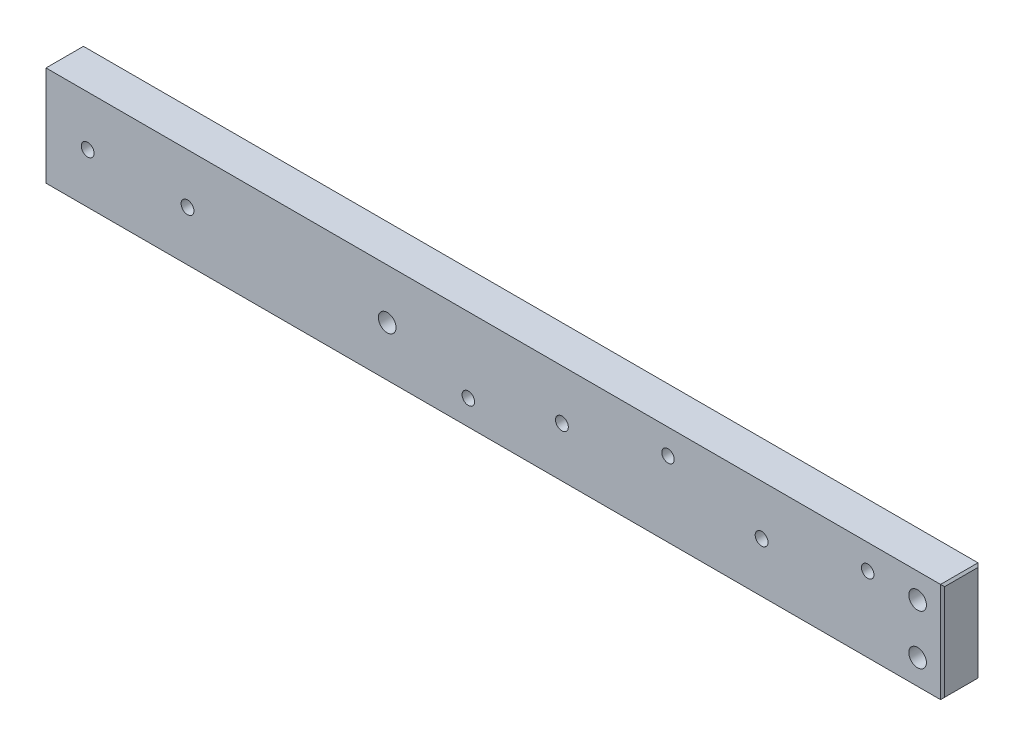
ISO-10303-21;
HEADER;
FILE_DESCRIPTION(('STEP AP214'),'2;1');
FILE_NAME('part.step','',(''),(''),'','','');
FILE_SCHEMA(('AUTOMOTIVE_DESIGN { 1 0 10303 214 1 1 1 1 }'));
ENDSEC;
DATA;
#1=APPLICATION_CONTEXT('core data for automotive mechanical design processes');
#2=APPLICATION_PROTOCOL_DEFINITION('international standard','automotive_design',2000,#1);
#3=PRODUCT_CONTEXT('',#1,'mechanical');
#4=PRODUCT('Part','Part','',(#3));
#5=PRODUCT_RELATED_PRODUCT_CATEGORY('part','',(#4));
#6=PRODUCT_DEFINITION_FORMATION('','',#4);
#7=PRODUCT_DEFINITION_CONTEXT('part definition',#1,'design');
#8=PRODUCT_DEFINITION('design','',#6,#7);
#9=PRODUCT_DEFINITION_SHAPE('','',#8);
#10=(LENGTH_UNIT() NAMED_UNIT(*) SI_UNIT(.MILLI.,.METRE.));
#11=(NAMED_UNIT(*) PLANE_ANGLE_UNIT() SI_UNIT($,.RADIAN.));
#12=(NAMED_UNIT(*) SI_UNIT($,.STERADIAN.) SOLID_ANGLE_UNIT());
#13=UNCERTAINTY_MEASURE_WITH_UNIT(LENGTH_MEASURE(1.E-05),#10,'distance_accuracy_value','');
#14=(GEOMETRIC_REPRESENTATION_CONTEXT(3) GLOBAL_UNCERTAINTY_ASSIGNED_CONTEXT((#13)) GLOBAL_UNIT_ASSIGNED_CONTEXT((#10,
#11,#12)) REPRESENTATION_CONTEXT('',''));
#15=CARTESIAN_POINT('',(0.,0.,0.));
#16=DIRECTION('',(0.,0.,1.));
#17=DIRECTION('',(1.,0.,0.));
#18=AXIS2_PLACEMENT_3D('',#15,#16,#17);
#19=CARTESIAN_POINT('',(0.,0.,9.525));
#20=DIRECTION('',(-1.,0.,0.));
#21=DIRECTION('',(0.,0.,1.));
#22=AXIS2_PLACEMENT_3D('',#19,#20,#21);
#23=PLANE('',#22);
#24=DIRECTION('',(0.,-1.,0.));
#25=VECTOR('',#24,1.);
#26=CARTESIAN_POINT('',(0.,0.,9.01699999999999));
#27=LINE('',#26,#25);
#28=CARTESIAN_POINT('',(0.,24.892,9.01699999999999));
#29=VERTEX_POINT('',#28);
#30=CARTESIAN_POINT('',(0.,0.508000000000008,9.01699999999999));
#31=VERTEX_POINT('',#30);
#32=EDGE_CURVE('E123',#29,#31,#27,.T.);
#33=ORIENTED_EDGE('',*,*,#32,.T.);
#34=DIRECTION('',(0.,0.,-1.));
#35=VECTOR('',#34,1.);
#36=CARTESIAN_POINT('',(0.,0.508000000000008,9.525));
#37=LINE('',#36,#35);
#38=CARTESIAN_POINT('',(0.,0.508000000000008,0.508000000000008));
#39=VERTEX_POINT('',#38);
#40=EDGE_CURVE('E105',#31,#39,#37,.T.);
#41=ORIENTED_EDGE('',*,*,#40,.T.);
#42=DIRECTION('',(0.,1.,0.));
#43=VECTOR('',#42,1.);
#44=CARTESIAN_POINT('',(0.,0.,0.508000000000008));
#45=LINE('',#44,#43);
#46=CARTESIAN_POINT('',(0.,24.892,0.508000000000008));
#47=VERTEX_POINT('',#46);
#48=EDGE_CURVE('E113',#39,#47,#45,.T.);
#49=ORIENTED_EDGE('',*,*,#48,.T.);
#50=DIRECTION('',(0.,0.,1.));
#51=VECTOR('',#50,1.);
#52=CARTESIAN_POINT('',(0.,24.892,9.525));
#53=LINE('',#52,#51);
#54=EDGE_CURVE('E119',#47,#29,#53,.T.);
#55=ORIENTED_EDGE('',*,*,#54,.T.);
#56=EDGE_LOOP('',(#33,#41,#49,#55));
#57=FACE_BOUND('',#56,.T.);
#58=ADVANCED_FACE('F35',(#57),#23,.F.);
#59=CARTESIAN_POINT('',(0.,25.4,9.525));
#60=DIRECTION('',(0.,-1.,0.));
#61=DIRECTION('',(1.,0.,0.));
#62=AXIS2_PLACEMENT_3D('',#59,#60,#61);
#63=PLANE('',#62);
#64=DIRECTION('',(-1.,0.,0.));
#65=VECTOR('',#64,1.);
#66=CARTESIAN_POINT('',(0.,25.4,9.525));
#67=LINE('',#66,#65);
#68=CARTESIAN_POINT('',(-0.508000000000008,25.4,9.525));
#69=VERTEX_POINT('',#68);
#70=CARTESIAN_POINT('',(-228.092,25.4,9.525));
#71=VERTEX_POINT('',#70);
#72=EDGE_CURVE('E182',#69,#71,#67,.T.);
#73=ORIENTED_EDGE('',*,*,#72,.F.);
#74=DIRECTION('',(0.,0.,-1.));
#75=VECTOR('',#74,1.);
#76=CARTESIAN_POINT('',(-0.508000000000008,25.4,9.525));
#77=LINE('',#76,#75);
#78=CARTESIAN_POINT('',(-0.508000000000008,25.4,0.));
#79=VERTEX_POINT('',#78);
#80=EDGE_CURVE('E139',#69,#79,#77,.T.);
#81=ORIENTED_EDGE('',*,*,#80,.T.);
#82=DIRECTION('',(-1.,0.,0.));
#83=VECTOR('',#82,1.);
#84=CARTESIAN_POINT('',(0.,25.4,0.));
#85=LINE('',#84,#83);
#86=CARTESIAN_POINT('',(-228.092,25.4,0.));
#87=VERTEX_POINT('',#86);
#88=EDGE_CURVE('E183',#79,#87,#85,.T.);
#89=ORIENTED_EDGE('',*,*,#88,.T.);
#90=DIRECTION('',(0.,0.,1.));
#91=VECTOR('',#90,1.);
#92=CARTESIAN_POINT('',(-228.092,25.4,9.525));
#93=LINE('',#92,#91);
#94=EDGE_CURVE('E136',#87,#71,#93,.T.);
#95=ORIENTED_EDGE('',*,*,#94,.T.);
#96=EDGE_LOOP('',(#73,#81,#89,#95));
#97=FACE_BOUND('',#96,.T.);
#98=ADVANCED_FACE('F297',(#97),#63,.F.);
#99=CARTESIAN_POINT('',(-228.6,0.,9.525));
#100=DIRECTION('',(1.,0.,0.));
#101=DIRECTION('',(0.,0.,-1.));
#102=AXIS2_PLACEMENT_3D('',#99,#100,#101);
#103=PLANE('',#102);
#104=DIRECTION('',(0.,1.,0.));
#105=VECTOR('',#104,1.);
#106=CARTESIAN_POINT('',(-228.6,25.4,9.01699999999999));
#107=LINE('',#106,#105);
#108=CARTESIAN_POINT('',(-228.6,0.50799999999998,9.01699999999999));
#109=VERTEX_POINT('',#108);
#110=CARTESIAN_POINT('',(-228.6,24.892,9.01699999999999));
#111=VERTEX_POINT('',#110);
#112=EDGE_CURVE('E44',#109,#111,#107,.T.);
#113=ORIENTED_EDGE('',*,*,#112,.T.);
#114=DIRECTION('',(0.,0.,-1.));
#115=VECTOR('',#114,1.);
#116=CARTESIAN_POINT('',(-228.6,24.892,9.525));
#117=LINE('',#116,#115);
#118=CARTESIAN_POINT('',(-228.6,24.892,0.508000000000008));
#119=VERTEX_POINT('',#118);
#120=EDGE_CURVE('E11',#111,#119,#117,.T.);
#121=ORIENTED_EDGE('',*,*,#120,.T.);
#122=DIRECTION('',(0.,-1.,0.));
#123=VECTOR('',#122,1.);
#124=CARTESIAN_POINT('',(-228.6,0.,0.508000000000008));
#125=LINE('',#124,#123);
#126=CARTESIAN_POINT('',(-228.6,0.50799999999998,0.508000000000008));
#127=VERTEX_POINT('',#126);
#128=EDGE_CURVE('E145',#119,#127,#125,.T.);
#129=ORIENTED_EDGE('',*,*,#128,.T.);
#130=DIRECTION('',(0.,0.,1.));
#131=VECTOR('',#130,1.);
#132=CARTESIAN_POINT('',(-228.6,0.50799999999998,9.525));
#133=LINE('',#132,#131);
#134=EDGE_CURVE('E55',#127,#109,#133,.T.);
#135=ORIENTED_EDGE('',*,*,#134,.T.);
#136=EDGE_LOOP('',(#113,#121,#129,#135));
#137=FACE_BOUND('',#136,.T.);
#138=ADVANCED_FACE('F302',(#137),#103,.F.);
#139=CARTESIAN_POINT('',(0.,0.,9.525));
#140=DIRECTION('',(0.,1.,0.));
#141=DIRECTION('',(-1.,0.,0.));
#142=AXIS2_PLACEMENT_3D('',#139,#140,#141);
#143=PLANE('',#142);
#144=DIRECTION('',(1.,0.,0.));
#145=VECTOR('',#144,1.);
#146=CARTESIAN_POINT('',(0.,0.,0.));
#147=LINE('',#146,#145);
#148=CARTESIAN_POINT('',(-228.092,0.,0.));
#149=VERTEX_POINT('',#148);
#150=CARTESIAN_POINT('',(-0.508000000000008,0.,0.));
#151=VERTEX_POINT('',#150);
#152=EDGE_CURVE('E176',#149,#151,#147,.T.);
#153=ORIENTED_EDGE('',*,*,#152,.T.);
#154=DIRECTION('',(0.,0.,1.));
#155=VECTOR('',#154,1.);
#156=CARTESIAN_POINT('',(-0.508000000000008,0.,9.525));
#157=LINE('',#156,#155);
#158=CARTESIAN_POINT('',(-0.508000000000008,0.,9.525));
#159=VERTEX_POINT('',#158);
#160=EDGE_CURVE('E107',#151,#159,#157,.T.);
#161=ORIENTED_EDGE('',*,*,#160,.T.);
#162=DIRECTION('',(1.,0.,0.));
#163=VECTOR('',#162,1.);
#164=CARTESIAN_POINT('',(0.,0.,9.525));
#165=LINE('',#164,#163);
#166=CARTESIAN_POINT('',(-228.092,0.,9.525));
#167=VERTEX_POINT('',#166);
#168=EDGE_CURVE('E120',#167,#159,#165,.T.);
#169=ORIENTED_EDGE('',*,*,#168,.F.);
#170=DIRECTION('',(0.,0.,-1.));
#171=VECTOR('',#170,1.);
#172=CARTESIAN_POINT('',(-228.092,0.,9.525));
#173=LINE('',#172,#171);
#174=EDGE_CURVE('E125',#167,#149,#173,.T.);
#175=ORIENTED_EDGE('',*,*,#174,.T.);
#176=EDGE_LOOP('',(#153,#161,#169,#175));
#177=FACE_BOUND('',#176,.T.);
#178=ADVANCED_FACE('F175',(#177),#143,.F.);
#179=CARTESIAN_POINT('',(0.,0.,9.525));
#180=DIRECTION('',(0.,0.,1.));
#181=DIRECTION('',(1.,0.,0.));
#182=AXIS2_PLACEMENT_3D('',#179,#180,#181);
#183=PLANE('',#182);
#184=CARTESIAN_POINT('',(-19.05,19.05,9.525));
#185=DIRECTION('',(0.,0.,1.));
#186=DIRECTION('',(1.,0.,0.));
#187=AXIS2_PLACEMENT_3D('',#184,#185,#186);
#188=CIRCLE('',#187,1.5875);
#189=CARTESIAN_POINT('',(-17.4625,19.05,9.525));
#190=VERTEX_POINT('',#189);
#191=EDGE_CURVE('E255',#190,#190,#188,.T.);
#192=ORIENTED_EDGE('',*,*,#191,.F.);
#193=EDGE_LOOP('',(#192));
#194=FACE_BOUND('',#193,.T.);
#195=CARTESIAN_POINT('',(-69.85,19.05,9.525));
#196=DIRECTION('',(0.,0.,1.));
#197=DIRECTION('',(1.,0.,0.));
#198=AXIS2_PLACEMENT_3D('',#195,#196,#197);
#199=CIRCLE('',#198,1.58750000000001);
#200=CARTESIAN_POINT('',(-68.2625,19.05,9.525));
#201=VERTEX_POINT('',#200);
#202=EDGE_CURVE('E249',#201,#201,#199,.T.);
#203=ORIENTED_EDGE('',*,*,#202,.F.);
#204=EDGE_LOOP('',(#203));
#205=FACE_BOUND('',#204,.T.);
#206=CARTESIAN_POINT('',(-120.65,6.34999999999997,9.525));
#207=DIRECTION('',(0.,0.,1.));
#208=DIRECTION('',(1.,0.,0.));
#209=AXIS2_PLACEMENT_3D('',#206,#207,#208);
#210=CIRCLE('',#209,1.58750000000001);
#211=CARTESIAN_POINT('',(-119.0625,6.34999999999997,9.525));
#212=VERTEX_POINT('',#211);
#213=EDGE_CURVE('E243',#212,#212,#210,.T.);
#214=ORIENTED_EDGE('',*,*,#213,.F.);
#215=EDGE_LOOP('',(#214));
#216=FACE_BOUND('',#215,.T.);
#217=CARTESIAN_POINT('',(-217.4875,12.7,9.525));
#218=DIRECTION('',(0.,0.,1.));
#219=DIRECTION('',(1.,0.,0.));
#220=AXIS2_PLACEMENT_3D('',#217,#218,#219);
#221=CIRCLE('',#220,1.63194999999999);
#222=CARTESIAN_POINT('',(-215.85555,12.7,9.525));
#223=VERTEX_POINT('',#222);
#224=EDGE_CURVE('E237',#223,#223,#221,.T.);
#225=ORIENTED_EDGE('',*,*,#224,.F.);
#226=EDGE_LOOP('',(#225));
#227=FACE_BOUND('',#226,.T.);
#228=CARTESIAN_POINT('',(-192.0875,12.7,9.525));
#229=DIRECTION('',(0.,0.,1.));
#230=DIRECTION('',(1.,0.,0.));
#231=AXIS2_PLACEMENT_3D('',#228,#229,#230);
#232=CIRCLE('',#231,1.63194999999999);
#233=CARTESIAN_POINT('',(-190.45555,12.7,9.525));
#234=VERTEX_POINT('',#233);
#235=EDGE_CURVE('E231',#234,#234,#232,.T.);
#236=ORIENTED_EDGE('',*,*,#235,.F.);
#237=EDGE_LOOP('',(#236));
#238=FACE_BOUND('',#237,.T.);
#239=CARTESIAN_POINT('',(-96.8375,12.7,9.525));
#240=DIRECTION('',(0.,0.,-1.));
#241=DIRECTION('',(-1.,0.,0.));
#242=AXIS2_PLACEMENT_3D('',#239,#240,#241);
#243=CIRCLE('',#242,1.63194999999999);
#244=CARTESIAN_POINT('',(-98.46945,12.7,9.525));
#245=VERTEX_POINT('',#244);
#246=EDGE_CURVE('E222',#245,#245,#243,.T.);
#247=ORIENTED_EDGE('',*,*,#246,.T.);
#248=EDGE_LOOP('',(#247));
#249=FACE_BOUND('',#248,.T.);
#250=CARTESIAN_POINT('',(-46.0375000000001,12.7,9.525));
#251=DIRECTION('',(0.,0.,-1.));
#252=DIRECTION('',(-1.,0.,0.));
#253=AXIS2_PLACEMENT_3D('',#250,#251,#252);
#254=CIRCLE('',#253,1.63194999999999);
#255=CARTESIAN_POINT('',(-47.66945,12.7,9.525));
#256=VERTEX_POINT('',#255);
#257=EDGE_CURVE('E158',#256,#256,#254,.T.);
#258=ORIENTED_EDGE('',*,*,#257,.T.);
#259=EDGE_LOOP('',(#258));
#260=FACE_BOUND('',#259,.T.);
#261=CARTESIAN_POINT('',(-141.2875,12.7,9.525));
#262=DIRECTION('',(0.,0.,1.));
#263=DIRECTION('',(1.,0.,0.));
#264=AXIS2_PLACEMENT_3D('',#261,#262,#263);
#265=CIRCLE('',#264,2.2479);
#266=CARTESIAN_POINT('',(-139.0396,12.7,9.525));
#267=VERTEX_POINT('',#266);
#268=EDGE_CURVE('E154',#267,#267,#265,.T.);
#269=ORIENTED_EDGE('',*,*,#268,.F.);
#270=EDGE_LOOP('',(#269));
#271=FACE_BOUND('',#270,.T.);
#272=CARTESIAN_POINT('',(-6.35,6.34999999999999,9.525));
#273=DIRECTION('',(0.,0.,1.));
#274=DIRECTION('',(1.,0.,0.));
#275=AXIS2_PLACEMENT_3D('',#272,#273,#274);
#276=CIRCLE('',#275,2.24789999999999);
#277=CARTESIAN_POINT('',(-4.10210000000001,6.34999999999999,9.525));
#278=VERTEX_POINT('',#277);
#279=EDGE_CURVE('E195',#278,#278,#276,.T.);
#280=ORIENTED_EDGE('',*,*,#279,.F.);
#281=EDGE_LOOP('',(#280));
#282=FACE_BOUND('',#281,.T.);
#283=CARTESIAN_POINT('',(-6.35,19.05,9.525));
#284=DIRECTION('',(0.,0.,1.));
#285=DIRECTION('',(1.,0.,0.));
#286=AXIS2_PLACEMENT_3D('',#283,#284,#285);
#287=CIRCLE('',#286,2.24789999999999);
#288=CARTESIAN_POINT('',(-4.10210000000001,19.05,9.525));
#289=VERTEX_POINT('',#288);
#290=EDGE_CURVE('E194',#289,#289,#287,.T.);
#291=ORIENTED_EDGE('',*,*,#290,.F.);
#292=EDGE_LOOP('',(#291));
#293=FACE_BOUND('',#292,.T.);
#294=ORIENTED_EDGE('',*,*,#168,.T.);
#295=DIRECTION('',(0.,1.,0.));
#296=VECTOR('',#295,1.);
#297=CARTESIAN_POINT('',(-0.508000000000008,25.4,9.525));
#298=LINE('',#297,#296);
#299=EDGE_CURVE('E134',#159,#69,#298,.T.);
#300=ORIENTED_EDGE('',*,*,#299,.T.);
#301=ORIENTED_EDGE('',*,*,#72,.T.);
#302=DIRECTION('',(0.,-1.,0.));
#303=VECTOR('',#302,1.);
#304=CARTESIAN_POINT('',(-228.092,0.,9.525));
#305=LINE('',#304,#303);
#306=EDGE_CURVE('E132',#71,#167,#305,.T.);
#307=ORIENTED_EDGE('',*,*,#306,.T.);
#308=EDGE_LOOP('',(#294,#300,#301,#307));
#309=FACE_BOUND('',#308,.T.);
#310=ADVANCED_FACE('F207',(#194,#205,#216,#227,#238,#249,#260,#271,#282,#293,#309),#183,.T.);
#311=CARTESIAN_POINT('',(0.,0.,0.));
#312=DIRECTION('',(0.,0.,1.));
#313=DIRECTION('',(1.,0.,0.));
#314=AXIS2_PLACEMENT_3D('',#311,#312,#313);
#315=PLANE('',#314);
#316=CARTESIAN_POINT('',(-19.05,19.05,0.));
#317=DIRECTION('',(0.,0.,1.));
#318=DIRECTION('',(1.,0.,0.));
#319=AXIS2_PLACEMENT_3D('',#316,#317,#318);
#320=CIRCLE('',#319,1.5875);
#321=CARTESIAN_POINT('',(-17.4625,19.05,0.));
#322=VERTEX_POINT('',#321);
#323=EDGE_CURVE('E252',#322,#322,#320,.T.);
#324=ORIENTED_EDGE('',*,*,#323,.T.);
#325=EDGE_LOOP('',(#324));
#326=FACE_BOUND('',#325,.T.);
#327=CARTESIAN_POINT('',(-69.85,19.05,0.));
#328=DIRECTION('',(0.,0.,1.));
#329=DIRECTION('',(1.,0.,0.));
#330=AXIS2_PLACEMENT_3D('',#327,#328,#329);
#331=CIRCLE('',#330,1.5875);
#332=CARTESIAN_POINT('',(-68.2625,19.05,0.));
#333=VERTEX_POINT('',#332);
#334=EDGE_CURVE('E246',#333,#333,#331,.T.);
#335=ORIENTED_EDGE('',*,*,#334,.T.);
#336=EDGE_LOOP('',(#335));
#337=FACE_BOUND('',#336,.T.);
#338=CARTESIAN_POINT('',(-120.65,6.34999999999997,0.));
#339=DIRECTION('',(0.,0.,1.));
#340=DIRECTION('',(1.,0.,0.));
#341=AXIS2_PLACEMENT_3D('',#338,#339,#340);
#342=CIRCLE('',#341,1.5875);
#343=CARTESIAN_POINT('',(-119.0625,6.34999999999997,0.));
#344=VERTEX_POINT('',#343);
#345=EDGE_CURVE('E240',#344,#344,#342,.T.);
#346=ORIENTED_EDGE('',*,*,#345,.T.);
#347=EDGE_LOOP('',(#346));
#348=FACE_BOUND('',#347,.T.);
#349=CARTESIAN_POINT('',(-217.4875,12.7,0.));
#350=DIRECTION('',(0.,0.,1.));
#351=DIRECTION('',(1.,0.,0.));
#352=AXIS2_PLACEMENT_3D('',#349,#350,#351);
#353=CIRCLE('',#352,1.63194999999999);
#354=CARTESIAN_POINT('',(-215.85555,12.7,0.));
#355=VERTEX_POINT('',#354);
#356=EDGE_CURVE('E234',#355,#355,#353,.T.);
#357=ORIENTED_EDGE('',*,*,#356,.T.);
#358=EDGE_LOOP('',(#357));
#359=FACE_BOUND('',#358,.T.);
#360=CARTESIAN_POINT('',(-192.0875,12.7,0.));
#361=DIRECTION('',(0.,0.,1.));
#362=DIRECTION('',(1.,0.,0.));
#363=AXIS2_PLACEMENT_3D('',#360,#361,#362);
#364=CIRCLE('',#363,1.63194999999999);
#365=CARTESIAN_POINT('',(-190.45555,12.7,0.));
#366=VERTEX_POINT('',#365);
#367=EDGE_CURVE('E228',#366,#366,#364,.T.);
#368=ORIENTED_EDGE('',*,*,#367,.T.);
#369=EDGE_LOOP('',(#368));
#370=FACE_BOUND('',#369,.T.);
#371=CARTESIAN_POINT('',(-96.8375,12.7,0.));
#372=DIRECTION('',(0.,0.,-1.));
#373=DIRECTION('',(-1.,0.,0.));
#374=AXIS2_PLACEMENT_3D('',#371,#372,#373);
#375=CIRCLE('',#374,1.63194999999999);
#376=CARTESIAN_POINT('',(-98.46945,12.7,0.));
#377=VERTEX_POINT('',#376);
#378=EDGE_CURVE('E225',#377,#377,#375,.T.);
#379=ORIENTED_EDGE('',*,*,#378,.F.);
#380=EDGE_LOOP('',(#379));
#381=FACE_BOUND('',#380,.T.);
#382=CARTESIAN_POINT('',(-46.0375000000001,12.7,0.));
#383=DIRECTION('',(0.,0.,-1.));
#384=DIRECTION('',(-1.,0.,0.));
#385=AXIS2_PLACEMENT_3D('',#382,#383,#384);
#386=CIRCLE('',#385,1.63194999999999);
#387=CARTESIAN_POINT('',(-47.66945,12.7,0.));
#388=VERTEX_POINT('',#387);
#389=EDGE_CURVE('E219',#388,#388,#386,.T.);
#390=ORIENTED_EDGE('',*,*,#389,.F.);
#391=EDGE_LOOP('',(#390));
#392=FACE_BOUND('',#391,.T.);
#393=CARTESIAN_POINT('',(-141.2875,12.7,0.));
#394=DIRECTION('',(0.,0.,1.));
#395=DIRECTION('',(1.,0.,0.));
#396=AXIS2_PLACEMENT_3D('',#393,#394,#395);
#397=CIRCLE('',#396,2.2479);
#398=CARTESIAN_POINT('',(-139.0396,12.7,0.));
#399=VERTEX_POINT('',#398);
#400=EDGE_CURVE('E196',#399,#399,#397,.T.);
#401=ORIENTED_EDGE('',*,*,#400,.T.);
#402=EDGE_LOOP('',(#401));
#403=FACE_BOUND('',#402,.T.);
#404=CARTESIAN_POINT('',(-6.35,6.34999999999999,0.));
#405=DIRECTION('',(0.,0.,1.));
#406=DIRECTION('',(1.,0.,0.));
#407=AXIS2_PLACEMENT_3D('',#404,#405,#406);
#408=CIRCLE('',#407,2.24789999999999);
#409=CARTESIAN_POINT('',(-4.10210000000001,6.34999999999999,0.));
#410=VERTEX_POINT('',#409);
#411=EDGE_CURVE('E191',#410,#410,#408,.T.);
#412=ORIENTED_EDGE('',*,*,#411,.T.);
#413=EDGE_LOOP('',(#412));
#414=FACE_BOUND('',#413,.T.);
#415=CARTESIAN_POINT('',(-6.35,19.05,0.));
#416=DIRECTION('',(0.,0.,1.));
#417=DIRECTION('',(1.,0.,0.));
#418=AXIS2_PLACEMENT_3D('',#415,#416,#417);
#419=CIRCLE('',#418,2.24789999999999);
#420=CARTESIAN_POINT('',(-4.10210000000001,19.05,0.));
#421=VERTEX_POINT('',#420);
#422=EDGE_CURVE('E187',#421,#421,#419,.T.);
#423=ORIENTED_EDGE('',*,*,#422,.T.);
#424=EDGE_LOOP('',(#423));
#425=FACE_BOUND('',#424,.T.);
#426=ORIENTED_EDGE('',*,*,#88,.F.);
#427=DIRECTION('',(0.,-1.,0.));
#428=VECTOR('',#427,1.);
#429=CARTESIAN_POINT('',(-0.508000000000008,0.,0.));
#430=LINE('',#429,#428);
#431=EDGE_CURVE('E143',#79,#151,#430,.T.);
#432=ORIENTED_EDGE('',*,*,#431,.T.);
#433=ORIENTED_EDGE('',*,*,#152,.F.);
#434=DIRECTION('',(0.,1.,0.));
#435=VECTOR('',#434,1.);
#436=CARTESIAN_POINT('',(-228.092,0.,0.));
#437=LINE('',#436,#435);
#438=EDGE_CURVE('E141',#149,#87,#437,.T.);
#439=ORIENTED_EDGE('',*,*,#438,.T.);
#440=EDGE_LOOP('',(#426,#432,#433,#439));
#441=FACE_BOUND('',#440,.T.);
#442=ADVANCED_FACE('F180',(#326,#337,#348,#359,#370,#381,#392,#403,#414,#425,#441),#315,.F.);
#443=CARTESIAN_POINT('',(-6.35,19.05,9.525));
#444=DIRECTION('',(0.,0.,1.));
#445=DIRECTION('',(1.,0.,0.));
#446=AXIS2_PLACEMENT_3D('',#443,#444,#445);
#447=CYLINDRICAL_SURFACE('',#446,2.24789999999999);
#448=ORIENTED_EDGE('',*,*,#290,.T.);
#449=EDGE_LOOP('',(#448));
#450=FACE_BOUND('',#449,.T.);
#451=ORIENTED_EDGE('',*,*,#422,.F.);
#452=EDGE_LOOP('',(#451));
#453=FACE_BOUND('',#452,.T.);
#454=ADVANCED_FACE('F282',(#450,#453),#447,.F.);
#455=CARTESIAN_POINT('',(-6.35,6.34999999999999,9.525));
#456=DIRECTION('',(0.,0.,1.));
#457=DIRECTION('',(1.,0.,0.));
#458=AXIS2_PLACEMENT_3D('',#455,#456,#457);
#459=CYLINDRICAL_SURFACE('',#458,2.24789999999999);
#460=ORIENTED_EDGE('',*,*,#279,.T.);
#461=EDGE_LOOP('',(#460));
#462=FACE_BOUND('',#461,.T.);
#463=ORIENTED_EDGE('',*,*,#411,.F.);
#464=EDGE_LOOP('',(#463));
#465=FACE_BOUND('',#464,.T.);
#466=ADVANCED_FACE('F285',(#462,#465),#459,.F.);
#467=CARTESIAN_POINT('',(-141.2875,12.7,9.525));
#468=DIRECTION('',(0.,0.,1.));
#469=DIRECTION('',(1.,0.,0.));
#470=AXIS2_PLACEMENT_3D('',#467,#468,#469);
#471=CYLINDRICAL_SURFACE('',#470,2.2479);
#472=ORIENTED_EDGE('',*,*,#268,.T.);
#473=EDGE_LOOP('',(#472));
#474=FACE_BOUND('',#473,.T.);
#475=ORIENTED_EDGE('',*,*,#400,.F.);
#476=EDGE_LOOP('',(#475));
#477=FACE_BOUND('',#476,.T.);
#478=ADVANCED_FACE('F315',(#474,#477),#471,.F.);
#479=CARTESIAN_POINT('',(-0.508000000000008,25.4,9.525));
#480=DIRECTION('',(-0.707106781186548,-0.707106781186547,0.));
#481=DIRECTION('',(0.,0.,-1.));
#482=AXIS2_PLACEMENT_3D('',#479,#480,#481);
#483=PLANE('',#482);
#484=DIRECTION('',(0.577350269189626,-0.577350269189626,0.577350269189626));
#485=VECTOR('',#484,1.);
#486=CARTESIAN_POINT('',(8.29733333333333,16.5946666666667,8.80533333333334));
#487=LINE('',#486,#485);
#488=EDGE_CURVE('E116',#79,#47,#487,.T.);
#489=ORIENTED_EDGE('',*,*,#488,.F.);
#490=ORIENTED_EDGE('',*,*,#80,.F.);
#491=DIRECTION('',(-0.577350269189626,0.577350269189626,0.577350269189626));
#492=VECTOR('',#491,1.);
#493=CARTESIAN_POINT('',(-0.508000000000008,25.4,9.525));
#494=LINE('',#493,#492);
#495=EDGE_CURVE('E151',#29,#69,#494,.T.);
#496=ORIENTED_EDGE('',*,*,#495,.F.);
#497=ORIENTED_EDGE('',*,*,#54,.F.);
#498=EDGE_LOOP('',(#489,#490,#496,#497));
#499=FACE_BOUND('',#498,.T.);
#500=ADVANCED_FACE('F201',(#499),#483,.F.);
#501=CARTESIAN_POINT('',(-0.508000000000008,0.,9.525));
#502=DIRECTION('',(0.707106781186548,0.,0.707106781186547));
#503=DIRECTION('',(0.,-1.,0.));
#504=AXIS2_PLACEMENT_3D('',#501,#502,#503);
#505=PLANE('',#504);
#506=ORIENTED_EDGE('',*,*,#495,.T.);
#507=ORIENTED_EDGE('',*,*,#299,.F.);
#508=DIRECTION('',(-0.577350269189626,-0.577350269189626,0.577350269189626));
#509=VECTOR('',#508,1.);
#510=CARTESIAN_POINT('',(-0.508000000000008,0.,9.525));
#511=LINE('',#510,#509);
#512=EDGE_CURVE('E110',#31,#159,#511,.T.);
#513=ORIENTED_EDGE('',*,*,#512,.F.);
#514=ORIENTED_EDGE('',*,*,#32,.F.);
#515=EDGE_LOOP('',(#506,#507,#513,#514));
#516=FACE_BOUND('',#515,.T.);
#517=ADVANCED_FACE('F204',(#516),#505,.T.);
#518=CARTESIAN_POINT('',(0.,0.,0.508000000000008));
#519=DIRECTION('',(-0.707106781186548,0.,0.707106781186547));
#520=DIRECTION('',(0.,1.,0.));
#521=AXIS2_PLACEMENT_3D('',#518,#519,#520);
#522=PLANE('',#521);
#523=ORIENTED_EDGE('',*,*,#488,.T.);
#524=ORIENTED_EDGE('',*,*,#48,.F.);
#525=DIRECTION('',(-0.577350269189626,-0.577350269189626,-0.577350269189626));
#526=VECTOR('',#525,1.);
#527=CARTESIAN_POINT('',(-0.169333333333336,0.338666666666672,0.338666666666672));
#528=LINE('',#527,#526);
#529=EDGE_CURVE('E101',#151,#39,#528,.F.);
#530=ORIENTED_EDGE('',*,*,#529,.F.);
#531=ORIENTED_EDGE('',*,*,#431,.F.);
#532=EDGE_LOOP('',(#523,#524,#530,#531));
#533=FACE_BOUND('',#532,.T.);
#534=ADVANCED_FACE('F114',(#533),#522,.F.);
#535=CARTESIAN_POINT('',(0.,0.508000000000008,9.525));
#536=DIRECTION('',(-0.707106781186548,0.707106781186548,0.));
#537=DIRECTION('',(0.,0.,-1.));
#538=AXIS2_PLACEMENT_3D('',#535,#536,#537);
#539=PLANE('',#538);
#540=ORIENTED_EDGE('',*,*,#512,.T.);
#541=ORIENTED_EDGE('',*,*,#160,.F.);
#542=ORIENTED_EDGE('',*,*,#529,.T.);
#543=ORIENTED_EDGE('',*,*,#40,.F.);
#544=EDGE_LOOP('',(#540,#541,#542,#543));
#545=FACE_BOUND('',#544,.T.);
#546=ADVANCED_FACE('F103',(#545),#539,.F.);
#547=CARTESIAN_POINT('',(-228.092,0.,9.525));
#548=DIRECTION('',(0.707106781186547,0.707106781186548,0.));
#549=DIRECTION('',(0.,0.,-1.));
#550=AXIS2_PLACEMENT_3D('',#547,#548,#549);
#551=PLANE('',#550);
#552=DIRECTION('',(-0.577350269189626,0.577350269189625,0.577350269189626));
#553=VECTOR('',#552,1.);
#554=CARTESIAN_POINT('',(-228.430666666667,0.338666666666644,0.338666666666672));
#555=LINE('',#554,#553);
#556=EDGE_CURVE('E159',#149,#127,#555,.T.);
#557=ORIENTED_EDGE('',*,*,#556,.F.);
#558=ORIENTED_EDGE('',*,*,#174,.F.);
#559=DIRECTION('',(0.577350269189626,-0.577350269189625,0.577350269189626));
#560=VECTOR('',#559,1.);
#561=CARTESIAN_POINT('',(-228.092,0.,9.525));
#562=LINE('',#561,#560);
#563=EDGE_CURVE('E39',#109,#167,#562,.T.);
#564=ORIENTED_EDGE('',*,*,#563,.F.);
#565=ORIENTED_EDGE('',*,*,#134,.F.);
#566=EDGE_LOOP('',(#557,#558,#564,#565));
#567=FACE_BOUND('',#566,.T.);
#568=ADVANCED_FACE('F37',(#567),#551,.F.);
#569=CARTESIAN_POINT('',(-228.092,0.,9.525));
#570=DIRECTION('',(-0.707106781186547,0.,0.707106781186547));
#571=DIRECTION('',(0.,1.,0.));
#572=AXIS2_PLACEMENT_3D('',#569,#570,#571);
#573=PLANE('',#572);
#574=ORIENTED_EDGE('',*,*,#563,.T.);
#575=ORIENTED_EDGE('',*,*,#306,.F.);
#576=DIRECTION('',(0.577350269189626,0.577350269189626,0.577350269189626));
#577=VECTOR('',#576,1.);
#578=CARTESIAN_POINT('',(-236.558666666667,16.9333333333333,1.05833333333334));
#579=LINE('',#578,#577);
#580=EDGE_CURVE('E157',#111,#71,#579,.T.);
#581=ORIENTED_EDGE('',*,*,#580,.F.);
#582=ORIENTED_EDGE('',*,*,#112,.F.);
#583=EDGE_LOOP('',(#574,#575,#581,#582));
#584=FACE_BOUND('',#583,.T.);
#585=ADVANCED_FACE('F168',(#584),#573,.T.);
#586=CARTESIAN_POINT('',(-228.6,0.,0.508000000000008));
#587=DIRECTION('',(0.707106781186547,0.,0.707106781186547));
#588=DIRECTION('',(0.,-1.,0.));
#589=AXIS2_PLACEMENT_3D('',#586,#587,#588);
#590=PLANE('',#589);
#591=ORIENTED_EDGE('',*,*,#556,.T.);
#592=ORIENTED_EDGE('',*,*,#128,.F.);
#593=DIRECTION('',(0.577350269189626,0.577350269189626,-0.577350269189626));
#594=VECTOR('',#593,1.);
#595=CARTESIAN_POINT('',(-236.897333333333,16.5946666666666,8.80533333333334));
#596=LINE('',#595,#594);
#597=EDGE_CURVE('E155',#87,#119,#596,.F.);
#598=ORIENTED_EDGE('',*,*,#597,.F.);
#599=ORIENTED_EDGE('',*,*,#438,.F.);
#600=EDGE_LOOP('',(#591,#592,#598,#599));
#601=FACE_BOUND('',#600,.T.);
#602=ADVANCED_FACE('F320',(#601),#590,.F.);
#603=CARTESIAN_POINT('',(-228.6,24.892,9.525));
#604=DIRECTION('',(0.707106781186547,-0.707106781186547,0.));
#605=DIRECTION('',(0.,0.,-1.));
#606=AXIS2_PLACEMENT_3D('',#603,#604,#605);
#607=PLANE('',#606);
#608=ORIENTED_EDGE('',*,*,#580,.T.);
#609=ORIENTED_EDGE('',*,*,#94,.F.);
#610=ORIENTED_EDGE('',*,*,#597,.T.);
#611=ORIENTED_EDGE('',*,*,#120,.F.);
#612=EDGE_LOOP('',(#608,#609,#610,#611));
#613=FACE_BOUND('',#612,.T.);
#614=ADVANCED_FACE('F316',(#613),#607,.F.);
#615=CARTESIAN_POINT('',(-46.0375000000001,12.7,0.));
#616=DIRECTION('',(0.,0.,-1.));
#617=DIRECTION('',(-1.,0.,0.));
#618=AXIS2_PLACEMENT_3D('',#615,#616,#617);
#619=CYLINDRICAL_SURFACE('',#618,1.63194999999999);
#620=ORIENTED_EDGE('',*,*,#257,.F.);
#621=EDGE_LOOP('',(#620));
#622=FACE_BOUND('',#621,.T.);
#623=ORIENTED_EDGE('',*,*,#389,.T.);
#624=EDGE_LOOP('',(#623));
#625=FACE_BOUND('',#624,.T.);
#626=ADVANCED_FACE('F319',(#622,#625),#619,.F.);
#627=CARTESIAN_POINT('',(-96.8375,12.7,0.));
#628=DIRECTION('',(0.,0.,-1.));
#629=DIRECTION('',(-1.,0.,0.));
#630=AXIS2_PLACEMENT_3D('',#627,#628,#629);
#631=CYLINDRICAL_SURFACE('',#630,1.63194999999999);
#632=ORIENTED_EDGE('',*,*,#246,.F.);
#633=EDGE_LOOP('',(#632));
#634=FACE_BOUND('',#633,.T.);
#635=ORIENTED_EDGE('',*,*,#378,.T.);
#636=EDGE_LOOP('',(#635));
#637=FACE_BOUND('',#636,.T.);
#638=ADVANCED_FACE('F406',(#634,#637),#631,.F.);
#639=CARTESIAN_POINT('',(-192.0875,12.7,9.525));
#640=DIRECTION('',(0.,0.,1.));
#641=DIRECTION('',(1.,0.,0.));
#642=AXIS2_PLACEMENT_3D('',#639,#640,#641);
#643=CYLINDRICAL_SURFACE('',#642,1.63194999999999);
#644=ORIENTED_EDGE('',*,*,#367,.F.);
#645=EDGE_LOOP('',(#644));
#646=FACE_BOUND('',#645,.T.);
#647=ORIENTED_EDGE('',*,*,#235,.T.);
#648=EDGE_LOOP('',(#647));
#649=FACE_BOUND('',#648,.T.);
#650=ADVANCED_FACE('F415',(#646,#649),#643,.F.);
#651=CARTESIAN_POINT('',(-217.4875,12.7,9.525));
#652=DIRECTION('',(0.,0.,1.));
#653=DIRECTION('',(1.,0.,0.));
#654=AXIS2_PLACEMENT_3D('',#651,#652,#653);
#655=CYLINDRICAL_SURFACE('',#654,1.63194999999999);
#656=ORIENTED_EDGE('',*,*,#356,.F.);
#657=EDGE_LOOP('',(#656));
#658=FACE_BOUND('',#657,.T.);
#659=ORIENTED_EDGE('',*,*,#224,.T.);
#660=EDGE_LOOP('',(#659));
#661=FACE_BOUND('',#660,.T.);
#662=ADVANCED_FACE('F424',(#658,#661),#655,.F.);
#663=CARTESIAN_POINT('',(-120.65,6.34999999999997,9.525));
#664=DIRECTION('',(0.,0.,1.));
#665=DIRECTION('',(1.,0.,0.));
#666=AXIS2_PLACEMENT_3D('',#663,#664,#665);
#667=CYLINDRICAL_SURFACE('',#666,1.5875);
#668=ORIENTED_EDGE('',*,*,#345,.F.);
#669=EDGE_LOOP('',(#668));
#670=FACE_BOUND('',#669,.T.);
#671=ORIENTED_EDGE('',*,*,#213,.T.);
#672=EDGE_LOOP('',(#671));
#673=FACE_BOUND('',#672,.T.);
#674=ADVANCED_FACE('F433',(#670,#673),#667,.F.);
#675=CARTESIAN_POINT('',(-69.85,19.05,9.525));
#676=DIRECTION('',(0.,0.,1.));
#677=DIRECTION('',(1.,0.,0.));
#678=AXIS2_PLACEMENT_3D('',#675,#676,#677);
#679=CYLINDRICAL_SURFACE('',#678,1.5875);
#680=ORIENTED_EDGE('',*,*,#334,.F.);
#681=EDGE_LOOP('',(#680));
#682=FACE_BOUND('',#681,.T.);
#683=ORIENTED_EDGE('',*,*,#202,.T.);
#684=EDGE_LOOP('',(#683));
#685=FACE_BOUND('',#684,.T.);
#686=ADVANCED_FACE('F443',(#682,#685),#679,.F.);
#687=CARTESIAN_POINT('',(-19.05,19.05,9.525));
#688=DIRECTION('',(0.,0.,1.));
#689=DIRECTION('',(1.,0.,0.));
#690=AXIS2_PLACEMENT_3D('',#687,#688,#689);
#691=CYLINDRICAL_SURFACE('',#690,1.5875);
#692=ORIENTED_EDGE('',*,*,#323,.F.);
#693=EDGE_LOOP('',(#692));
#694=FACE_BOUND('',#693,.T.);
#695=ORIENTED_EDGE('',*,*,#191,.T.);
#696=EDGE_LOOP('',(#695));
#697=FACE_BOUND('',#696,.T.);
#698=ADVANCED_FACE('F259',(#694,#697),#691,.F.);
#699=CLOSED_SHELL('',(#58,#98,#138,#178,#310,#442,#454,#466,#478,#500,#517,#534,#546,#568,#585,
#602,#614,#626,#638,#650,#662,#674,#686,#698));
#700=MANIFOLD_SOLID_BREP('B2',#699);
#701=ADVANCED_BREP_SHAPE_REPRESENTATION('',(#18,#700),#14);
#702=SHAPE_DEFINITION_REPRESENTATION(#9,#701);
ENDSEC;
END-ISO-10303-21;
